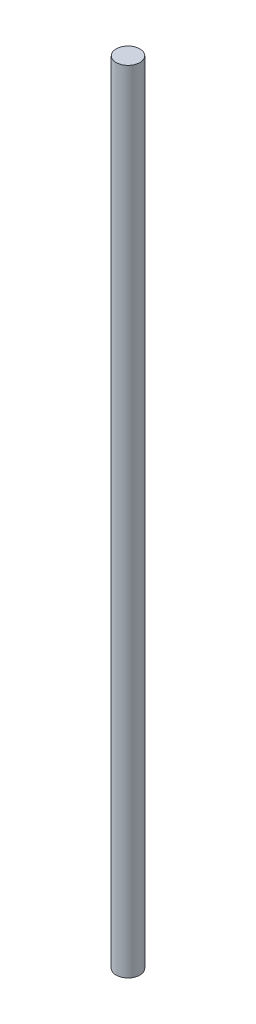
ISO-10303-21;
HEADER;
FILE_DESCRIPTION(('STEP AP214'),'2;1');
FILE_NAME('part.step','',(''),(''),'','','');
FILE_SCHEMA(('AUTOMOTIVE_DESIGN { 1 0 10303 214 1 1 1 1 }'));
ENDSEC;
DATA;
#1=APPLICATION_CONTEXT('core data for automotive mechanical design processes');
#2=APPLICATION_PROTOCOL_DEFINITION('international standard','automotive_design',2000,#1);
#3=PRODUCT_CONTEXT('',#1,'mechanical');
#4=PRODUCT('Part','Part','',(#3));
#5=PRODUCT_RELATED_PRODUCT_CATEGORY('part','',(#4));
#6=PRODUCT_DEFINITION_FORMATION('','',#4);
#7=PRODUCT_DEFINITION_CONTEXT('part definition',#1,'design');
#8=PRODUCT_DEFINITION('design','',#6,#7);
#9=PRODUCT_DEFINITION_SHAPE('','',#8);
#10=(LENGTH_UNIT() NAMED_UNIT(*) SI_UNIT(.MILLI.,.METRE.));
#11=(NAMED_UNIT(*) PLANE_ANGLE_UNIT() SI_UNIT($,.RADIAN.));
#12=(NAMED_UNIT(*) SI_UNIT($,.STERADIAN.) SOLID_ANGLE_UNIT());
#13=UNCERTAINTY_MEASURE_WITH_UNIT(LENGTH_MEASURE(1.E-05),#10,'distance_accuracy_value','');
#14=(GEOMETRIC_REPRESENTATION_CONTEXT(3) GLOBAL_UNCERTAINTY_ASSIGNED_CONTEXT((#13)) GLOBAL_UNIT_ASSIGNED_CONTEXT((#10,
#11,#12)) REPRESENTATION_CONTEXT('',''));
#15=CARTESIAN_POINT('',(0.,0.,0.));
#16=DIRECTION('',(0.,0.,1.));
#17=DIRECTION('',(1.,0.,0.));
#18=AXIS2_PLACEMENT_3D('',#15,#16,#17);
#19=CARTESIAN_POINT('',(0.,152.4,0.));
#20=DIRECTION('',(0.,-1.,0.));
#21=DIRECTION('',(0.,0.,-1.));
#22=AXIS2_PLACEMENT_3D('',#19,#20,#21);
#23=CYLINDRICAL_SURFACE('',#22,2.286);
#24=CARTESIAN_POINT('',(0.,152.4,0.));
#25=DIRECTION('',(0.,1.,0.));
#26=DIRECTION('',(0.,0.,1.));
#27=AXIS2_PLACEMENT_3D('',#24,#25,#26);
#28=CIRCLE('',#27,2.286);
#29=CARTESIAN_POINT('',(0.,152.4,2.286));
#30=VERTEX_POINT('',#29);
#31=EDGE_CURVE('E10',#30,#30,#28,.T.);
#32=ORIENTED_EDGE('',*,*,#31,.F.);
#33=EDGE_LOOP('',(#32));
#34=FACE_BOUND('',#33,.T.);
#35=CARTESIAN_POINT('',(0.,0.,0.));
#36=DIRECTION('',(0.,1.,0.));
#37=DIRECTION('',(0.,0.,1.));
#38=AXIS2_PLACEMENT_3D('',#35,#36,#37);
#39=CIRCLE('',#38,2.286);
#40=CARTESIAN_POINT('',(0.,0.,2.286));
#41=VERTEX_POINT('',#40);
#42=EDGE_CURVE('E40',#41,#41,#39,.T.);
#43=ORIENTED_EDGE('',*,*,#42,.T.);
#44=EDGE_LOOP('',(#43));
#45=FACE_BOUND('',#44,.T.);
#46=ADVANCED_FACE('F37',(#34,#45),#23,.T.);
#47=CARTESIAN_POINT('',(0.,152.4,0.));
#48=DIRECTION('',(0.,1.,0.));
#49=DIRECTION('',(0.,0.,1.));
#50=AXIS2_PLACEMENT_3D('',#47,#48,#49);
#51=PLANE('',#50);
#52=ORIENTED_EDGE('',*,*,#31,.T.);
#53=EDGE_LOOP('',(#52));
#54=FACE_BOUND('',#53,.T.);
#55=ADVANCED_FACE('F54',(#54),#51,.T.);
#56=CARTESIAN_POINT('',(0.,0.,0.));
#57=DIRECTION('',(0.,1.,0.));
#58=DIRECTION('',(0.,0.,1.));
#59=AXIS2_PLACEMENT_3D('',#56,#57,#58);
#60=PLANE('',#59);
#61=ORIENTED_EDGE('',*,*,#42,.F.);
#62=EDGE_LOOP('',(#61));
#63=FACE_BOUND('',#62,.T.);
#64=ADVANCED_FACE('F52',(#63),#60,.F.);
#65=CLOSED_SHELL('',(#46,#55,#64));
#66=MANIFOLD_SOLID_BREP('B2',#65);
#67=ADVANCED_BREP_SHAPE_REPRESENTATION('',(#18,#66),#14);
#68=SHAPE_DEFINITION_REPRESENTATION(#9,#67);
ENDSEC;
END-ISO-10303-21;
